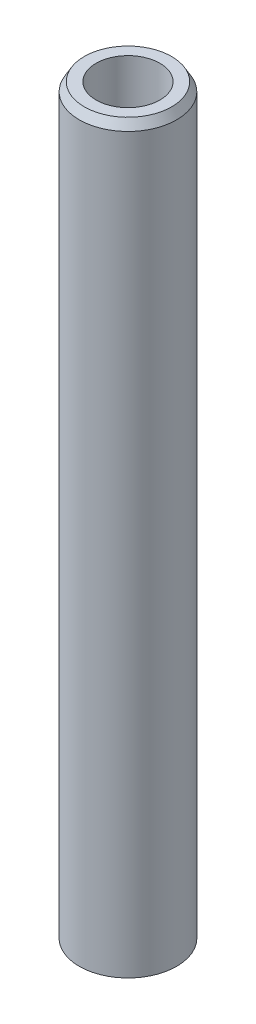
ISO-10303-21;
HEADER;
FILE_DESCRIPTION(('STEP AP214'),'2;1');
FILE_NAME('part.step','',(''),(''),'','','');
FILE_SCHEMA(('AUTOMOTIVE_DESIGN { 1 0 10303 214 1 1 1 1 }'));
ENDSEC;
DATA;
#1=APPLICATION_CONTEXT('core data for automotive mechanical design processes');
#2=APPLICATION_PROTOCOL_DEFINITION('international standard','automotive_design',2000,#1);
#3=PRODUCT_CONTEXT('',#1,'mechanical');
#4=PRODUCT('Part','Part','',(#3));
#5=PRODUCT_RELATED_PRODUCT_CATEGORY('part','',(#4));
#6=PRODUCT_DEFINITION_FORMATION('','',#4);
#7=PRODUCT_DEFINITION_CONTEXT('part definition',#1,'design');
#8=PRODUCT_DEFINITION('design','',#6,#7);
#9=PRODUCT_DEFINITION_SHAPE('','',#8);
#10=(LENGTH_UNIT() NAMED_UNIT(*) SI_UNIT(.MILLI.,.METRE.));
#11=(NAMED_UNIT(*) PLANE_ANGLE_UNIT() SI_UNIT($,.RADIAN.));
#12=(NAMED_UNIT(*) SI_UNIT($,.STERADIAN.) SOLID_ANGLE_UNIT());
#13=UNCERTAINTY_MEASURE_WITH_UNIT(LENGTH_MEASURE(1.E-05),#10,'distance_accuracy_value','');
#14=(GEOMETRIC_REPRESENTATION_CONTEXT(3) GLOBAL_UNCERTAINTY_ASSIGNED_CONTEXT((#13)) GLOBAL_UNIT_ASSIGNED_CONTEXT((#10,
#11,#12)) REPRESENTATION_CONTEXT('',''));
#15=CARTESIAN_POINT('',(0.,0.,0.));
#16=DIRECTION('',(0.,0.,1.));
#17=DIRECTION('',(1.,0.,0.));
#18=AXIS2_PLACEMENT_3D('',#15,#16,#17);
#19=CARTESIAN_POINT('',(0.,306.705013330676,0.));
#20=DIRECTION('',(0.,-1.,0.));
#21=DIRECTION('',(0.,0.,-1.));
#22=AXIS2_PLACEMENT_3D('',#19,#20,#21);
#23=CYLINDRICAL_SURFACE('',#22,20.);
#24=CARTESIAN_POINT('',(0.,303.118934445873,0.));
#25=DIRECTION('',(0.,1.,0.));
#26=DIRECTION('',(0.,0.,1.));
#27=AXIS2_PLACEMENT_3D('',#24,#25,#26);
#28=CIRCLE('',#27,20.);
#29=CARTESIAN_POINT('',(0.,303.118934445873,20.));
#30=VERTEX_POINT('',#29);
#31=EDGE_CURVE('E50',#30,#30,#28,.F.);
#32=ORIENTED_EDGE('',*,*,#31,.T.);
#33=EDGE_LOOP('',(#32));
#34=FACE_BOUND('',#33,.T.);
#35=CARTESIAN_POINT('',(0.,2.07042360947657,0.));
#36=DIRECTION('',(0.,1.,0.));
#37=DIRECTION('',(0.,0.,1.));
#38=AXIS2_PLACEMENT_3D('',#35,#36,#37);
#39=CIRCLE('',#38,20.);
#40=CARTESIAN_POINT('',(0.,2.07042360947657,20.));
#41=VERTEX_POINT('',#40);
#42=EDGE_CURVE('E51',#41,#41,#39,.T.);
#43=ORIENTED_EDGE('',*,*,#42,.T.);
#44=EDGE_LOOP('',(#43));
#45=FACE_BOUND('',#44,.T.);
#46=ADVANCED_FACE('F39',(#34,#45),#23,.T.);
#47=CARTESIAN_POINT('',(0.,306.705013330676,0.));
#48=DIRECTION('',(0.,1.,0.));
#49=DIRECTION('',(0.,0.,1.));
#50=AXIS2_PLACEMENT_3D('',#47,#48,#49);
#51=PLANE('',#50);
#52=CARTESIAN_POINT('',(0.,306.705013330676,0.));
#53=DIRECTION('',(0.,1.,0.));
#54=DIRECTION('',(0.,0.,1.));
#55=AXIS2_PLACEMENT_3D('',#52,#53,#54);
#56=CIRCLE('',#55,17.9295763905235);
#57=CARTESIAN_POINT('',(0.,306.705013330676,17.9295763905235));
#58=VERTEX_POINT('',#57);
#59=EDGE_CURVE('E54',#58,#58,#56,.T.);
#60=ORIENTED_EDGE('',*,*,#59,.T.);
#61=EDGE_LOOP('',(#60));
#62=FACE_BOUND('',#61,.T.);
#63=CARTESIAN_POINT('',(0.,306.705013330676,0.));
#64=DIRECTION('',(0.,1.,0.));
#65=DIRECTION('',(0.,0.,1.));
#66=AXIS2_PLACEMENT_3D('',#63,#64,#65);
#67=CIRCLE('',#66,13.1040282498431);
#68=CARTESIAN_POINT('',(0.,306.705013330676,13.1040282498431));
#69=VERTEX_POINT('',#68);
#70=EDGE_CURVE('E58',#69,#69,#67,.T.);
#71=ORIENTED_EDGE('',*,*,#70,.F.);
#72=EDGE_LOOP('',(#71));
#73=FACE_BOUND('',#72,.T.);
#74=ADVANCED_FACE('F69',(#62,#73),#51,.T.);
#75=CARTESIAN_POINT('',(0.,0.,0.));
#76=DIRECTION('',(0.,1.,0.));
#77=DIRECTION('',(0.,0.,1.));
#78=AXIS2_PLACEMENT_3D('',#75,#76,#77);
#79=PLANE('',#78);
#80=CARTESIAN_POINT('',(0.,0.,0.));
#81=DIRECTION('',(0.,1.,0.));
#82=DIRECTION('',(0.,0.,1.));
#83=AXIS2_PLACEMENT_3D('',#80,#81,#82);
#84=CIRCLE('',#83,16.4139211151965);
#85=CARTESIAN_POINT('',(0.,0.,16.4139211151965));
#86=VERTEX_POINT('',#85);
#87=EDGE_CURVE('E10',#86,#86,#84,.F.);
#88=ORIENTED_EDGE('',*,*,#87,.T.);
#89=EDGE_LOOP('',(#88));
#90=FACE_BOUND('',#89,.T.);
#91=CARTESIAN_POINT('',(0.,0.,0.));
#92=DIRECTION('',(0.,1.,0.));
#93=DIRECTION('',(0.,0.,1.));
#94=AXIS2_PLACEMENT_3D('',#91,#92,#93);
#95=CIRCLE('',#94,13.1040282498431);
#96=CARTESIAN_POINT('',(0.,0.,13.1040282498431));
#97=VERTEX_POINT('',#96);
#98=EDGE_CURVE('E63',#97,#97,#95,.T.);
#99=ORIENTED_EDGE('',*,*,#98,.T.);
#100=EDGE_LOOP('',(#99));
#101=FACE_BOUND('',#100,.T.);
#102=ADVANCED_FACE('F75',(#90,#101),#79,.F.);
#103=CARTESIAN_POINT('',(0.,306.705013330676,0.));
#104=DIRECTION('',(0.,-1.,0.));
#105=DIRECTION('',(0.,0.,-1.));
#106=AXIS2_PLACEMENT_3D('',#103,#104,#105);
#107=CYLINDRICAL_SURFACE('',#106,13.1040282498431);
#108=ORIENTED_EDGE('',*,*,#70,.T.);
#109=EDGE_LOOP('',(#108));
#110=FACE_BOUND('',#109,.T.);
#111=ORIENTED_EDGE('',*,*,#98,.F.);
#112=EDGE_LOOP('',(#111));
#113=FACE_BOUND('',#112,.T.);
#114=ADVANCED_FACE('F70',(#110,#113),#107,.F.);
#115=CARTESIAN_POINT('',(0.,306.705013330676,0.));
#116=DIRECTION('',(0.,-1.,0.));
#117=DIRECTION('',(0.,0.,-1.));
#118=AXIS2_PLACEMENT_3D('',#115,#116,#117);
#119=CONICAL_SURFACE('',#118,17.9295763905235,0.523598775598291);
#120=ORIENTED_EDGE('',*,*,#31,.F.);
#121=EDGE_LOOP('',(#120));
#122=FACE_BOUND('',#121,.T.);
#123=ORIENTED_EDGE('',*,*,#59,.F.);
#124=EDGE_LOOP('',(#123));
#125=FACE_BOUND('',#124,.T.);
#126=ADVANCED_FACE('F81',(#122,#125),#119,.T.);
#127=CARTESIAN_POINT('',(0.,2.07042360947657,0.));
#128=DIRECTION('',(0.,1.,0.));
#129=DIRECTION('',(0.,0.,1.));
#130=AXIS2_PLACEMENT_3D('',#127,#128,#129);
#131=CONICAL_SURFACE('',#130,20.,1.0471975511966);
#132=ORIENTED_EDGE('',*,*,#87,.F.);
#133=EDGE_LOOP('',(#132));
#134=FACE_BOUND('',#133,.T.);
#135=ORIENTED_EDGE('',*,*,#42,.F.);
#136=EDGE_LOOP('',(#135));
#137=FACE_BOUND('',#136,.T.);
#138=ADVANCED_FACE('F45',(#134,#137),#131,.T.);
#139=CLOSED_SHELL('',(#46,#74,#102,#114,#126,#138));
#140=MANIFOLD_SOLID_BREP('B2',#139);
#141=ADVANCED_BREP_SHAPE_REPRESENTATION('',(#18,#140),#14);
#142=SHAPE_DEFINITION_REPRESENTATION(#9,#141);
ENDSEC;
END-ISO-10303-21;
